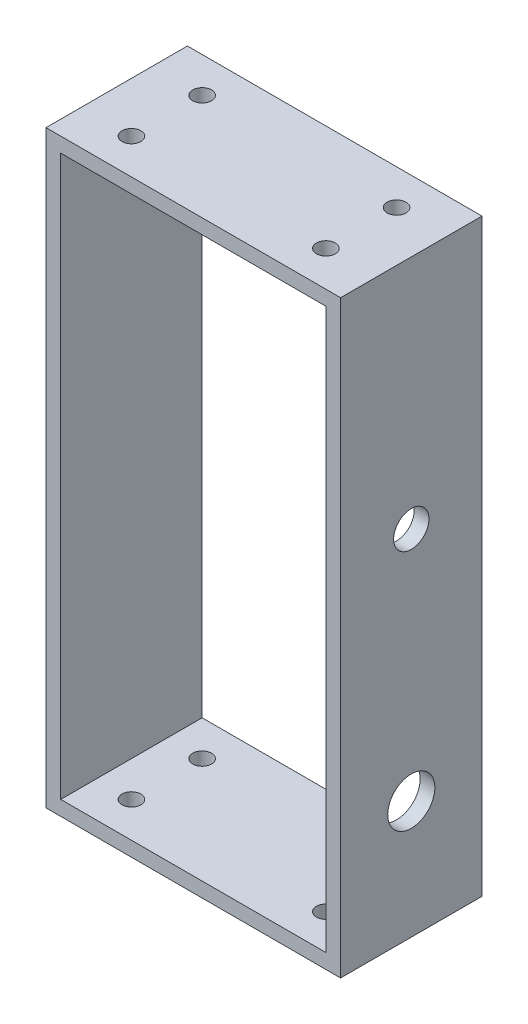
ISO-10303-21;
HEADER;
FILE_DESCRIPTION(('STEP AP214'),'2;1');
FILE_NAME('part.step','',(''),(''),'','','');
FILE_SCHEMA(('AUTOMOTIVE_DESIGN { 1 0 10303 214 1 1 1 1 }'));
ENDSEC;
DATA;
#1=APPLICATION_CONTEXT('core data for automotive mechanical design processes');
#2=APPLICATION_PROTOCOL_DEFINITION('international standard','automotive_design',2000,#1);
#3=PRODUCT_CONTEXT('',#1,'mechanical');
#4=PRODUCT('Part','Part','',(#3));
#5=PRODUCT_RELATED_PRODUCT_CATEGORY('part','',(#4));
#6=PRODUCT_DEFINITION_FORMATION('','',#4);
#7=PRODUCT_DEFINITION_CONTEXT('part definition',#1,'design');
#8=PRODUCT_DEFINITION('design','',#6,#7);
#9=PRODUCT_DEFINITION_SHAPE('','',#8);
#10=(LENGTH_UNIT() NAMED_UNIT(*) SI_UNIT(.MILLI.,.METRE.));
#11=(NAMED_UNIT(*) PLANE_ANGLE_UNIT() SI_UNIT($,.RADIAN.));
#12=(NAMED_UNIT(*) SI_UNIT($,.STERADIAN.) SOLID_ANGLE_UNIT());
#13=UNCERTAINTY_MEASURE_WITH_UNIT(LENGTH_MEASURE(1.E-05),#10,'distance_accuracy_value','');
#14=(GEOMETRIC_REPRESENTATION_CONTEXT(3) GLOBAL_UNCERTAINTY_ASSIGNED_CONTEXT((#13)) GLOBAL_UNIT_ASSIGNED_CONTEXT((#10,
#11,#12)) REPRESENTATION_CONTEXT('',''));
#15=CARTESIAN_POINT('',(0.,0.,0.));
#16=DIRECTION('',(0.,0.,1.));
#17=DIRECTION('',(1.,0.,0.));
#18=AXIS2_PLACEMENT_3D('',#15,#16,#17);
#19=CARTESIAN_POINT('',(0.,0.,24.));
#20=DIRECTION('',(0.,0.,1.));
#21=DIRECTION('',(1.,0.,0.));
#22=AXIS2_PLACEMENT_3D('',#19,#20,#21);
#23=PLANE('',#22);
#24=DIRECTION('',(0.,1.,0.));
#25=VECTOR('',#24,1.);
#26=CARTESIAN_POINT('',(25.,50.,24.));
#27=LINE('',#26,#25);
#28=CARTESIAN_POINT('',(25.,-50.,24.));
#29=VERTEX_POINT('',#28);
#30=CARTESIAN_POINT('',(25.,50.,24.));
#31=VERTEX_POINT('',#30);
#32=EDGE_CURVE('E143',#29,#31,#27,.T.);
#33=ORIENTED_EDGE('',*,*,#32,.T.);
#34=DIRECTION('',(-1.,0.,0.));
#35=VECTOR('',#34,1.);
#36=CARTESIAN_POINT('',(-25.,50.,24.));
#37=LINE('',#36,#35);
#38=CARTESIAN_POINT('',(-25.,50.,24.));
#39=VERTEX_POINT('',#38);
#40=EDGE_CURVE('E146',#31,#39,#37,.T.);
#41=ORIENTED_EDGE('',*,*,#40,.T.);
#42=DIRECTION('',(0.,-1.,0.));
#43=VECTOR('',#42,1.);
#44=CARTESIAN_POINT('',(-25.,50.,24.));
#45=LINE('',#44,#43);
#46=CARTESIAN_POINT('',(-25.,-50.,24.));
#47=VERTEX_POINT('',#46);
#48=EDGE_CURVE('E149',#39,#47,#45,.T.);
#49=ORIENTED_EDGE('',*,*,#48,.T.);
#50=DIRECTION('',(1.,0.,0.));
#51=VECTOR('',#50,1.);
#52=CARTESIAN_POINT('',(-25.,-50.,24.));
#53=LINE('',#52,#51);
#54=EDGE_CURVE('E151',#47,#29,#53,.T.);
#55=ORIENTED_EDGE('',*,*,#54,.T.);
#56=EDGE_LOOP('',(#33,#41,#49,#55));
#57=FACE_BOUND('',#56,.T.);
#58=DIRECTION('',(1.,0.,0.));
#59=VECTOR('',#58,1.);
#60=CARTESIAN_POINT('',(-22.5,-47.5,24.));
#61=LINE('',#60,#59);
#62=CARTESIAN_POINT('',(-22.5,-47.5,24.));
#63=VERTEX_POINT('',#62);
#64=CARTESIAN_POINT('',(22.5,-47.5,24.));
#65=VERTEX_POINT('',#64);
#66=EDGE_CURVE('E113',#63,#65,#61,.T.);
#67=ORIENTED_EDGE('',*,*,#66,.F.);
#68=DIRECTION('',(0.,-1.,0.));
#69=VECTOR('',#68,1.);
#70=CARTESIAN_POINT('',(-22.5,47.5,24.));
#71=LINE('',#70,#69);
#72=CARTESIAN_POINT('',(-22.5,47.5,24.));
#73=VERTEX_POINT('',#72);
#74=EDGE_CURVE('E105',#73,#63,#71,.T.);
#75=ORIENTED_EDGE('',*,*,#74,.F.);
#76=DIRECTION('',(-1.,0.,0.));
#77=VECTOR('',#76,1.);
#78=CARTESIAN_POINT('',(-22.5,47.5,24.));
#79=LINE('',#78,#77);
#80=CARTESIAN_POINT('',(22.5,47.5,24.));
#81=VERTEX_POINT('',#80);
#82=EDGE_CURVE('E127',#81,#73,#79,.T.);
#83=ORIENTED_EDGE('',*,*,#82,.F.);
#84=DIRECTION('',(0.,1.,0.));
#85=VECTOR('',#84,1.);
#86=CARTESIAN_POINT('',(22.5,47.5,24.));
#87=LINE('',#86,#85);
#88=EDGE_CURVE('E125',#65,#81,#87,.T.);
#89=ORIENTED_EDGE('',*,*,#88,.F.);
#90=EDGE_LOOP('',(#67,#75,#83,#89));
#91=FACE_BOUND('',#90,.T.);
#92=ADVANCED_FACE('F38',(#57,#91),#23,.T.);
#93=CARTESIAN_POINT('',(0.,0.,0.));
#94=DIRECTION('',(0.,0.,1.));
#95=DIRECTION('',(1.,0.,0.));
#96=AXIS2_PLACEMENT_3D('',#93,#94,#95);
#97=PLANE('',#96);
#98=DIRECTION('',(0.,1.,0.));
#99=VECTOR('',#98,1.);
#100=CARTESIAN_POINT('',(25.,50.,0.));
#101=LINE('',#100,#99);
#102=CARTESIAN_POINT('',(25.,-50.,0.));
#103=VERTEX_POINT('',#102);
#104=CARTESIAN_POINT('',(25.,50.,0.));
#105=VERTEX_POINT('',#104);
#106=EDGE_CURVE('E121',#103,#105,#101,.T.);
#107=ORIENTED_EDGE('',*,*,#106,.F.);
#108=DIRECTION('',(1.,0.,0.));
#109=VECTOR('',#108,1.);
#110=CARTESIAN_POINT('',(-25.,-50.,0.));
#111=LINE('',#110,#109);
#112=CARTESIAN_POINT('',(-25.,-50.,0.));
#113=VERTEX_POINT('',#112);
#114=EDGE_CURVE('E147',#113,#103,#111,.T.);
#115=ORIENTED_EDGE('',*,*,#114,.F.);
#116=DIRECTION('',(0.,-1.,0.));
#117=VECTOR('',#116,1.);
#118=CARTESIAN_POINT('',(-25.,50.,0.));
#119=LINE('',#118,#117);
#120=CARTESIAN_POINT('',(-25.,50.,0.));
#121=VERTEX_POINT('',#120);
#122=EDGE_CURVE('E158',#121,#113,#119,.T.);
#123=ORIENTED_EDGE('',*,*,#122,.F.);
#124=DIRECTION('',(-1.,0.,0.));
#125=VECTOR('',#124,1.);
#126=CARTESIAN_POINT('',(-25.,50.,0.));
#127=LINE('',#126,#125);
#128=EDGE_CURVE('E156',#105,#121,#127,.T.);
#129=ORIENTED_EDGE('',*,*,#128,.F.);
#130=EDGE_LOOP('',(#107,#115,#123,#129));
#131=FACE_BOUND('',#130,.T.);
#132=DIRECTION('',(0.,-1.,0.));
#133=VECTOR('',#132,1.);
#134=CARTESIAN_POINT('',(-22.5,47.5,0.));
#135=LINE('',#134,#133);
#136=CARTESIAN_POINT('',(-22.5,47.5,0.));
#137=VERTEX_POINT('',#136);
#138=CARTESIAN_POINT('',(-22.5,-47.5,0.));
#139=VERTEX_POINT('',#138);
#140=EDGE_CURVE('E63',#137,#139,#135,.T.);
#141=ORIENTED_EDGE('',*,*,#140,.T.);
#142=DIRECTION('',(1.,0.,0.));
#143=VECTOR('',#142,1.);
#144=CARTESIAN_POINT('',(-22.5,-47.5,0.));
#145=LINE('',#144,#143);
#146=CARTESIAN_POINT('',(22.5,-47.5,0.));
#147=VERTEX_POINT('',#146);
#148=EDGE_CURVE('E120',#139,#147,#145,.T.);
#149=ORIENTED_EDGE('',*,*,#148,.T.);
#150=DIRECTION('',(0.,1.,0.));
#151=VECTOR('',#150,1.);
#152=CARTESIAN_POINT('',(22.5,47.5,0.));
#153=LINE('',#152,#151);
#154=CARTESIAN_POINT('',(22.5,47.5,0.));
#155=VERTEX_POINT('',#154);
#156=EDGE_CURVE('E135',#147,#155,#153,.T.);
#157=ORIENTED_EDGE('',*,*,#156,.T.);
#158=DIRECTION('',(-1.,0.,0.));
#159=VECTOR('',#158,1.);
#160=CARTESIAN_POINT('',(-22.5,47.5,0.));
#161=LINE('',#160,#159);
#162=EDGE_CURVE('E114',#155,#137,#161,.T.);
#163=ORIENTED_EDGE('',*,*,#162,.T.);
#164=EDGE_LOOP('',(#141,#149,#157,#163));
#165=FACE_BOUND('',#164,.T.);
#166=ADVANCED_FACE('F228',(#131,#165),#97,.F.);
#167=CARTESIAN_POINT('',(25.,50.,24.));
#168=DIRECTION('',(-1.,0.,0.));
#169=DIRECTION('',(0.,-1.,0.));
#170=AXIS2_PLACEMENT_3D('',#167,#168,#169);
#171=PLANE('',#170);
#172=CARTESIAN_POINT('',(25.,9.99999999999997,12.));
#173=DIRECTION('',(-1.,0.,0.));
#174=DIRECTION('',(0.,-1.,0.));
#175=AXIS2_PLACEMENT_3D('',#172,#173,#174);
#176=CIRCLE('',#175,3.);
#177=CARTESIAN_POINT('',(25.,6.99999999999997,12.));
#178=VERTEX_POINT('',#177);
#179=EDGE_CURVE('E256',#178,#178,#176,.F.);
#180=ORIENTED_EDGE('',*,*,#179,.F.);
#181=EDGE_LOOP('',(#180));
#182=FACE_BOUND('',#181,.T.);
#183=CARTESIAN_POINT('',(25.,-30.,12.));
#184=DIRECTION('',(-1.,0.,0.));
#185=DIRECTION('',(0.,-1.,0.));
#186=AXIS2_PLACEMENT_3D('',#183,#184,#185);
#187=CIRCLE('',#186,4.);
#188=CARTESIAN_POINT('',(25.,-34.,12.));
#189=VERTEX_POINT('',#188);
#190=EDGE_CURVE('E260',#189,#189,#187,.F.);
#191=ORIENTED_EDGE('',*,*,#190,.F.);
#192=EDGE_LOOP('',(#191));
#193=FACE_BOUND('',#192,.T.);
#194=ORIENTED_EDGE('',*,*,#106,.T.);
#195=DIRECTION('',(0.,0.,-1.));
#196=VECTOR('',#195,1.);
#197=CARTESIAN_POINT('',(25.,50.,24.));
#198=LINE('',#197,#196);
#199=EDGE_CURVE('E11',#31,#105,#198,.T.);
#200=ORIENTED_EDGE('',*,*,#199,.F.);
#201=ORIENTED_EDGE('',*,*,#32,.F.);
#202=DIRECTION('',(0.,0.,-1.));
#203=VECTOR('',#202,1.);
#204=CARTESIAN_POINT('',(25.,-50.,24.));
#205=LINE('',#204,#203);
#206=EDGE_CURVE('E153',#29,#103,#205,.T.);
#207=ORIENTED_EDGE('',*,*,#206,.T.);
#208=EDGE_LOOP('',(#194,#200,#201,#207));
#209=FACE_BOUND('',#208,.T.);
#210=ADVANCED_FACE('F40',(#182,#193,#209),#171,.F.);
#211=CARTESIAN_POINT('',(-25.,50.,24.));
#212=DIRECTION('',(0.,-1.,0.));
#213=DIRECTION('',(0.,0.,-1.));
#214=AXIS2_PLACEMENT_3D('',#211,#212,#213);
#215=PLANE('',#214);
#216=CARTESIAN_POINT('',(16.5,50.,6.));
#217=DIRECTION('',(0.,-1.,0.));
#218=DIRECTION('',(0.,0.,-1.));
#219=AXIS2_PLACEMENT_3D('',#216,#217,#218);
#220=CIRCLE('',#219,1.6);
#221=CARTESIAN_POINT('',(16.5,50.,4.4));
#222=VERTEX_POINT('',#221);
#223=EDGE_CURVE('E133',#222,#222,#220,.T.);
#224=ORIENTED_EDGE('',*,*,#223,.T.);
#225=EDGE_LOOP('',(#224));
#226=FACE_BOUND('',#225,.T.);
#227=CARTESIAN_POINT('',(-16.5,50.,18.));
#228=DIRECTION('',(0.,-1.,0.));
#229=DIRECTION('',(0.,0.,-1.));
#230=AXIS2_PLACEMENT_3D('',#227,#228,#229);
#231=CIRCLE('',#230,1.6);
#232=CARTESIAN_POINT('',(-16.5,50.,16.4));
#233=VERTEX_POINT('',#232);
#234=EDGE_CURVE('E184',#233,#233,#231,.T.);
#235=ORIENTED_EDGE('',*,*,#234,.T.);
#236=EDGE_LOOP('',(#235));
#237=FACE_BOUND('',#236,.T.);
#238=CARTESIAN_POINT('',(16.5,50.,18.));
#239=DIRECTION('',(0.,-1.,0.));
#240=DIRECTION('',(0.,0.,-1.));
#241=AXIS2_PLACEMENT_3D('',#238,#239,#240);
#242=CIRCLE('',#241,1.6);
#243=CARTESIAN_POINT('',(16.5,50.,16.4));
#244=VERTEX_POINT('',#243);
#245=EDGE_CURVE('E180',#244,#244,#242,.T.);
#246=ORIENTED_EDGE('',*,*,#245,.T.);
#247=EDGE_LOOP('',(#246));
#248=FACE_BOUND('',#247,.T.);
#249=CARTESIAN_POINT('',(-16.5,50.,6.));
#250=DIRECTION('',(0.,-1.,0.));
#251=DIRECTION('',(0.,0.,-1.));
#252=AXIS2_PLACEMENT_3D('',#249,#250,#251);
#253=CIRCLE('',#252,1.6);
#254=CARTESIAN_POINT('',(-16.5,50.,4.4));
#255=VERTEX_POINT('',#254);
#256=EDGE_CURVE('E176',#255,#255,#253,.T.);
#257=ORIENTED_EDGE('',*,*,#256,.T.);
#258=EDGE_LOOP('',(#257));
#259=FACE_BOUND('',#258,.T.);
#260=ORIENTED_EDGE('',*,*,#128,.T.);
#261=DIRECTION('',(0.,0.,-1.));
#262=VECTOR('',#261,1.);
#263=CARTESIAN_POINT('',(-25.,50.,24.));
#264=LINE('',#263,#262);
#265=EDGE_CURVE('E47',#39,#121,#264,.T.);
#266=ORIENTED_EDGE('',*,*,#265,.F.);
#267=ORIENTED_EDGE('',*,*,#40,.F.);
#268=ORIENTED_EDGE('',*,*,#199,.T.);
#269=EDGE_LOOP('',(#260,#266,#267,#268));
#270=FACE_BOUND('',#269,.T.);
#271=ADVANCED_FACE('F201',(#226,#237,#248,#259,#270),#215,.F.);
#272=CARTESIAN_POINT('',(-25.,50.,24.));
#273=DIRECTION('',(1.,0.,0.));
#274=DIRECTION('',(0.,1.,0.));
#275=AXIS2_PLACEMENT_3D('',#272,#273,#274);
#276=PLANE('',#275);
#277=ORIENTED_EDGE('',*,*,#122,.T.);
#278=DIRECTION('',(0.,0.,-1.));
#279=VECTOR('',#278,1.);
#280=CARTESIAN_POINT('',(-25.,-50.,24.));
#281=LINE('',#280,#279);
#282=EDGE_CURVE('E163',#47,#113,#281,.T.);
#283=ORIENTED_EDGE('',*,*,#282,.F.);
#284=ORIENTED_EDGE('',*,*,#48,.F.);
#285=ORIENTED_EDGE('',*,*,#265,.T.);
#286=EDGE_LOOP('',(#277,#283,#284,#285));
#287=FACE_BOUND('',#286,.T.);
#288=ADVANCED_FACE('F242',(#287),#276,.F.);
#289=CARTESIAN_POINT('',(-25.,-50.,24.));
#290=DIRECTION('',(0.,1.,0.));
#291=DIRECTION('',(0.,0.,1.));
#292=AXIS2_PLACEMENT_3D('',#289,#290,#291);
#293=PLANE('',#292);
#294=CARTESIAN_POINT('',(16.5,-50.,6.));
#295=DIRECTION('',(0.,1.,0.));
#296=DIRECTION('',(0.,0.,1.));
#297=AXIS2_PLACEMENT_3D('',#294,#295,#296);
#298=CIRCLE('',#297,1.6);
#299=CARTESIAN_POINT('',(16.5,-50.,7.6));
#300=VERTEX_POINT('',#299);
#301=EDGE_CURVE('E307',#300,#300,#298,.T.);
#302=ORIENTED_EDGE('',*,*,#301,.T.);
#303=EDGE_LOOP('',(#302));
#304=FACE_BOUND('',#303,.T.);
#305=CARTESIAN_POINT('',(-16.5,-50.,18.));
#306=DIRECTION('',(0.,1.,0.));
#307=DIRECTION('',(0.,0.,1.));
#308=AXIS2_PLACEMENT_3D('',#305,#306,#307);
#309=CIRCLE('',#308,1.6);
#310=CARTESIAN_POINT('',(-16.5,-50.,19.6));
#311=VERTEX_POINT('',#310);
#312=EDGE_CURVE('E308',#311,#311,#309,.T.);
#313=ORIENTED_EDGE('',*,*,#312,.T.);
#314=EDGE_LOOP('',(#313));
#315=FACE_BOUND('',#314,.T.);
#316=CARTESIAN_POINT('',(16.5,-50.,18.));
#317=DIRECTION('',(0.,1.,0.));
#318=DIRECTION('',(0.,0.,1.));
#319=AXIS2_PLACEMENT_3D('',#316,#317,#318);
#320=CIRCLE('',#319,1.6);
#321=CARTESIAN_POINT('',(16.5,-50.,19.6));
#322=VERTEX_POINT('',#321);
#323=EDGE_CURVE('E311',#322,#322,#320,.T.);
#324=ORIENTED_EDGE('',*,*,#323,.T.);
#325=EDGE_LOOP('',(#324));
#326=FACE_BOUND('',#325,.T.);
#327=CARTESIAN_POINT('',(-16.5,-50.,6.));
#328=DIRECTION('',(0.,1.,0.));
#329=DIRECTION('',(0.,0.,1.));
#330=AXIS2_PLACEMENT_3D('',#327,#328,#329);
#331=CIRCLE('',#330,1.6);
#332=CARTESIAN_POINT('',(-16.5,-50.,7.6));
#333=VERTEX_POINT('',#332);
#334=EDGE_CURVE('E172',#333,#333,#331,.T.);
#335=ORIENTED_EDGE('',*,*,#334,.T.);
#336=EDGE_LOOP('',(#335));
#337=FACE_BOUND('',#336,.T.);
#338=ORIENTED_EDGE('',*,*,#114,.T.);
#339=ORIENTED_EDGE('',*,*,#206,.F.);
#340=ORIENTED_EDGE('',*,*,#54,.F.);
#341=ORIENTED_EDGE('',*,*,#282,.T.);
#342=EDGE_LOOP('',(#338,#339,#340,#341));
#343=FACE_BOUND('',#342,.T.);
#344=ADVANCED_FACE('F239',(#304,#315,#326,#337,#343),#293,.F.);
#345=CARTESIAN_POINT('',(-22.5,47.5,24.));
#346=DIRECTION('',(1.,0.,0.));
#347=DIRECTION('',(0.,1.,0.));
#348=AXIS2_PLACEMENT_3D('',#345,#346,#347);
#349=PLANE('',#348);
#350=ORIENTED_EDGE('',*,*,#140,.F.);
#351=DIRECTION('',(0.,0.,-1.));
#352=VECTOR('',#351,1.);
#353=CARTESIAN_POINT('',(-22.5,47.5,24.));
#354=LINE('',#353,#352);
#355=EDGE_CURVE('E109',#73,#137,#354,.T.);
#356=ORIENTED_EDGE('',*,*,#355,.F.);
#357=ORIENTED_EDGE('',*,*,#74,.T.);
#358=DIRECTION('',(0.,0.,-1.));
#359=VECTOR('',#358,1.);
#360=CARTESIAN_POINT('',(-22.5,-47.5,24.));
#361=LINE('',#360,#359);
#362=EDGE_CURVE('E108',#63,#139,#361,.T.);
#363=ORIENTED_EDGE('',*,*,#362,.T.);
#364=EDGE_LOOP('',(#350,#356,#357,#363));
#365=FACE_BOUND('',#364,.T.);
#366=ADVANCED_FACE('F107',(#365),#349,.T.);
#367=CARTESIAN_POINT('',(-22.5,-47.5,24.));
#368=DIRECTION('',(0.,1.,0.));
#369=DIRECTION('',(0.,0.,1.));
#370=AXIS2_PLACEMENT_3D('',#367,#368,#369);
#371=PLANE('',#370);
#372=CARTESIAN_POINT('',(16.5,-47.5,6.));
#373=DIRECTION('',(0.,1.,0.));
#374=DIRECTION('',(0.,0.,1.));
#375=AXIS2_PLACEMENT_3D('',#372,#373,#374);
#376=CIRCLE('',#375,1.6);
#377=CARTESIAN_POINT('',(16.5,-47.5,7.6));
#378=VERTEX_POINT('',#377);
#379=EDGE_CURVE('E196',#378,#378,#376,.T.);
#380=ORIENTED_EDGE('',*,*,#379,.F.);
#381=EDGE_LOOP('',(#380));
#382=FACE_BOUND('',#381,.T.);
#383=CARTESIAN_POINT('',(-16.5,-47.5,18.));
#384=DIRECTION('',(0.,1.,0.));
#385=DIRECTION('',(0.,0.,1.));
#386=AXIS2_PLACEMENT_3D('',#383,#384,#385);
#387=CIRCLE('',#386,1.6);
#388=CARTESIAN_POINT('',(-16.5,-47.5,19.6));
#389=VERTEX_POINT('',#388);
#390=EDGE_CURVE('E179',#389,#389,#387,.T.);
#391=ORIENTED_EDGE('',*,*,#390,.F.);
#392=EDGE_LOOP('',(#391));
#393=FACE_BOUND('',#392,.T.);
#394=CARTESIAN_POINT('',(16.5,-47.5,18.));
#395=DIRECTION('',(0.,1.,0.));
#396=DIRECTION('',(0.,0.,1.));
#397=AXIS2_PLACEMENT_3D('',#394,#395,#396);
#398=CIRCLE('',#397,1.6);
#399=CARTESIAN_POINT('',(16.5,-47.5,19.6));
#400=VERTEX_POINT('',#399);
#401=EDGE_CURVE('E175',#400,#400,#398,.T.);
#402=ORIENTED_EDGE('',*,*,#401,.F.);
#403=EDGE_LOOP('',(#402));
#404=FACE_BOUND('',#403,.T.);
#405=CARTESIAN_POINT('',(-16.5,-47.5,6.));
#406=DIRECTION('',(0.,1.,0.));
#407=DIRECTION('',(0.,0.,1.));
#408=AXIS2_PLACEMENT_3D('',#405,#406,#407);
#409=CIRCLE('',#408,1.6);
#410=CARTESIAN_POINT('',(-16.5,-47.5,7.6));
#411=VERTEX_POINT('',#410);
#412=EDGE_CURVE('E171',#411,#411,#409,.T.);
#413=ORIENTED_EDGE('',*,*,#412,.F.);
#414=EDGE_LOOP('',(#413));
#415=FACE_BOUND('',#414,.T.);
#416=ORIENTED_EDGE('',*,*,#148,.F.);
#417=ORIENTED_EDGE('',*,*,#362,.F.);
#418=ORIENTED_EDGE('',*,*,#66,.T.);
#419=DIRECTION('',(0.,0.,-1.));
#420=VECTOR('',#419,1.);
#421=CARTESIAN_POINT('',(22.5,-47.5,24.));
#422=LINE('',#421,#420);
#423=EDGE_CURVE('E122',#65,#147,#422,.T.);
#424=ORIENTED_EDGE('',*,*,#423,.T.);
#425=EDGE_LOOP('',(#416,#417,#418,#424));
#426=FACE_BOUND('',#425,.T.);
#427=ADVANCED_FACE('F117',(#382,#393,#404,#415,#426),#371,.T.);
#428=CARTESIAN_POINT('',(22.5,47.5,24.));
#429=DIRECTION('',(-1.,0.,0.));
#430=DIRECTION('',(0.,-1.,0.));
#431=AXIS2_PLACEMENT_3D('',#428,#429,#430);
#432=PLANE('',#431);
#433=CARTESIAN_POINT('',(22.5,9.99999999999997,12.));
#434=DIRECTION('',(-1.,0.,0.));
#435=DIRECTION('',(0.,-1.,0.));
#436=AXIS2_PLACEMENT_3D('',#433,#434,#435);
#437=CIRCLE('',#436,3.);
#438=CARTESIAN_POINT('',(22.5,6.99999999999997,12.));
#439=VERTEX_POINT('',#438);
#440=EDGE_CURVE('E318',#439,#439,#437,.F.);
#441=ORIENTED_EDGE('',*,*,#440,.T.);
#442=EDGE_LOOP('',(#441));
#443=FACE_BOUND('',#442,.T.);
#444=CARTESIAN_POINT('',(22.5,-30.,12.));
#445=DIRECTION('',(-1.,0.,0.));
#446=DIRECTION('',(0.,-1.,0.));
#447=AXIS2_PLACEMENT_3D('',#444,#445,#446);
#448=CIRCLE('',#447,4.);
#449=CARTESIAN_POINT('',(22.5,-34.,12.));
#450=VERTEX_POINT('',#449);
#451=EDGE_CURVE('E319',#450,#450,#448,.F.);
#452=ORIENTED_EDGE('',*,*,#451,.T.);
#453=EDGE_LOOP('',(#452));
#454=FACE_BOUND('',#453,.T.);
#455=ORIENTED_EDGE('',*,*,#156,.F.);
#456=ORIENTED_EDGE('',*,*,#423,.F.);
#457=ORIENTED_EDGE('',*,*,#88,.T.);
#458=DIRECTION('',(0.,0.,-1.));
#459=VECTOR('',#458,1.);
#460=CARTESIAN_POINT('',(22.5,47.5,24.));
#461=LINE('',#460,#459);
#462=EDGE_CURVE('E55',#81,#155,#461,.T.);
#463=ORIENTED_EDGE('',*,*,#462,.T.);
#464=EDGE_LOOP('',(#455,#456,#457,#463));
#465=FACE_BOUND('',#464,.T.);
#466=ADVANCED_FACE('F277',(#443,#454,#465),#432,.T.);
#467=CARTESIAN_POINT('',(-22.5,47.5,24.));
#468=DIRECTION('',(0.,-1.,0.));
#469=DIRECTION('',(0.,0.,-1.));
#470=AXIS2_PLACEMENT_3D('',#467,#468,#469);
#471=PLANE('',#470);
#472=CARTESIAN_POINT('',(16.5,47.5,6.));
#473=DIRECTION('',(0.,-1.,0.));
#474=DIRECTION('',(0.,0.,-1.));
#475=AXIS2_PLACEMENT_3D('',#472,#473,#474);
#476=CIRCLE('',#475,1.6);
#477=CARTESIAN_POINT('',(16.5,47.5,4.4));
#478=VERTEX_POINT('',#477);
#479=EDGE_CURVE('E42',#478,#478,#476,.T.);
#480=ORIENTED_EDGE('',*,*,#479,.F.);
#481=EDGE_LOOP('',(#480));
#482=FACE_BOUND('',#481,.T.);
#483=CARTESIAN_POINT('',(-16.5,47.5,18.));
#484=DIRECTION('',(0.,-1.,0.));
#485=DIRECTION('',(0.,0.,-1.));
#486=AXIS2_PLACEMENT_3D('',#483,#484,#485);
#487=CIRCLE('',#486,1.6);
#488=CARTESIAN_POINT('',(-16.5,47.5,16.4));
#489=VERTEX_POINT('',#488);
#490=EDGE_CURVE('E177',#489,#489,#487,.T.);
#491=ORIENTED_EDGE('',*,*,#490,.F.);
#492=EDGE_LOOP('',(#491));
#493=FACE_BOUND('',#492,.T.);
#494=CARTESIAN_POINT('',(16.5,47.5,18.));
#495=DIRECTION('',(0.,-1.,0.));
#496=DIRECTION('',(0.,0.,-1.));
#497=AXIS2_PLACEMENT_3D('',#494,#495,#496);
#498=CIRCLE('',#497,1.6);
#499=CARTESIAN_POINT('',(16.5,47.5,16.4));
#500=VERTEX_POINT('',#499);
#501=EDGE_CURVE('E173',#500,#500,#498,.T.);
#502=ORIENTED_EDGE('',*,*,#501,.F.);
#503=EDGE_LOOP('',(#502));
#504=FACE_BOUND('',#503,.T.);
#505=CARTESIAN_POINT('',(-16.5,47.5,6.));
#506=DIRECTION('',(0.,-1.,0.));
#507=DIRECTION('',(0.,0.,-1.));
#508=AXIS2_PLACEMENT_3D('',#505,#506,#507);
#509=CIRCLE('',#508,1.6);
#510=CARTESIAN_POINT('',(-16.5,47.5,4.4));
#511=VERTEX_POINT('',#510);
#512=EDGE_CURVE('E168',#511,#511,#509,.T.);
#513=ORIENTED_EDGE('',*,*,#512,.F.);
#514=EDGE_LOOP('',(#513));
#515=FACE_BOUND('',#514,.T.);
#516=ORIENTED_EDGE('',*,*,#162,.F.);
#517=ORIENTED_EDGE('',*,*,#462,.F.);
#518=ORIENTED_EDGE('',*,*,#82,.T.);
#519=ORIENTED_EDGE('',*,*,#355,.T.);
#520=EDGE_LOOP('',(#516,#517,#518,#519));
#521=FACE_BOUND('',#520,.T.);
#522=ADVANCED_FACE('F275',(#482,#493,#504,#515,#521),#471,.T.);
#523=CARTESIAN_POINT('',(-16.5,-50.,6.));
#524=DIRECTION('',(0.,1.,0.));
#525=DIRECTION('',(0.,0.,1.));
#526=AXIS2_PLACEMENT_3D('',#523,#524,#525);
#527=CYLINDRICAL_SURFACE('',#526,1.6);
#528=ORIENTED_EDGE('',*,*,#512,.T.);
#529=EDGE_LOOP('',(#528));
#530=FACE_BOUND('',#529,.T.);
#531=ORIENTED_EDGE('',*,*,#256,.F.);
#532=EDGE_LOOP('',(#531));
#533=FACE_BOUND('',#532,.T.);
#534=ADVANCED_FACE('F218',(#530,#533),#527,.F.);
#535=CARTESIAN_POINT('',(16.5,-50.,18.));
#536=DIRECTION('',(0.,1.,0.));
#537=DIRECTION('',(0.,0.,1.));
#538=AXIS2_PLACEMENT_3D('',#535,#536,#537);
#539=CYLINDRICAL_SURFACE('',#538,1.6);
#540=ORIENTED_EDGE('',*,*,#501,.T.);
#541=EDGE_LOOP('',(#540));
#542=FACE_BOUND('',#541,.T.);
#543=ORIENTED_EDGE('',*,*,#245,.F.);
#544=EDGE_LOOP('',(#543));
#545=FACE_BOUND('',#544,.T.);
#546=ADVANCED_FACE('F219',(#542,#545),#539,.F.);
#547=CARTESIAN_POINT('',(-16.5,-50.,18.));
#548=DIRECTION('',(0.,1.,0.));
#549=DIRECTION('',(0.,0.,1.));
#550=AXIS2_PLACEMENT_3D('',#547,#548,#549);
#551=CYLINDRICAL_SURFACE('',#550,1.6);
#552=ORIENTED_EDGE('',*,*,#490,.T.);
#553=EDGE_LOOP('',(#552));
#554=FACE_BOUND('',#553,.T.);
#555=ORIENTED_EDGE('',*,*,#234,.F.);
#556=EDGE_LOOP('',(#555));
#557=FACE_BOUND('',#556,.T.);
#558=ADVANCED_FACE('F207',(#554,#557),#551,.F.);
#559=CARTESIAN_POINT('',(16.5,-50.,6.));
#560=DIRECTION('',(0.,1.,0.));
#561=DIRECTION('',(0.,0.,1.));
#562=AXIS2_PLACEMENT_3D('',#559,#560,#561);
#563=CYLINDRICAL_SURFACE('',#562,1.6);
#564=ORIENTED_EDGE('',*,*,#479,.T.);
#565=EDGE_LOOP('',(#564));
#566=FACE_BOUND('',#565,.T.);
#567=ORIENTED_EDGE('',*,*,#223,.F.);
#568=EDGE_LOOP('',(#567));
#569=FACE_BOUND('',#568,.T.);
#570=ADVANCED_FACE('F204',(#566,#569),#563,.F.);
#571=ORIENTED_EDGE('',*,*,#412,.T.);
#572=EDGE_LOOP('',(#571));
#573=FACE_BOUND('',#572,.T.);
#574=ORIENTED_EDGE('',*,*,#334,.F.);
#575=EDGE_LOOP('',(#574));
#576=FACE_BOUND('',#575,.T.);
#577=ADVANCED_FACE('F206',(#573,#576),#527,.F.);
#578=ORIENTED_EDGE('',*,*,#401,.T.);
#579=EDGE_LOOP('',(#578));
#580=FACE_BOUND('',#579,.T.);
#581=ORIENTED_EDGE('',*,*,#323,.F.);
#582=EDGE_LOOP('',(#581));
#583=FACE_BOUND('',#582,.T.);
#584=ADVANCED_FACE('F215',(#580,#583),#539,.F.);
#585=ORIENTED_EDGE('',*,*,#390,.T.);
#586=EDGE_LOOP('',(#585));
#587=FACE_BOUND('',#586,.T.);
#588=ORIENTED_EDGE('',*,*,#312,.F.);
#589=EDGE_LOOP('',(#588));
#590=FACE_BOUND('',#589,.T.);
#591=ADVANCED_FACE('F221',(#587,#590),#551,.F.);
#592=ORIENTED_EDGE('',*,*,#379,.T.);
#593=EDGE_LOOP('',(#592));
#594=FACE_BOUND('',#593,.T.);
#595=ORIENTED_EDGE('',*,*,#301,.F.);
#596=EDGE_LOOP('',(#595));
#597=FACE_BOUND('',#596,.T.);
#598=ADVANCED_FACE('F210',(#594,#597),#563,.F.);
#599=CARTESIAN_POINT('',(25.000012,-30.,12.));
#600=DIRECTION('',(-1.,0.,0.));
#601=DIRECTION('',(0.,-1.,0.));
#602=AXIS2_PLACEMENT_3D('',#599,#600,#601);
#603=CYLINDRICAL_SURFACE('',#602,4.);
#604=CARTESIAN_POINT('',(22.5,-34.,12.));
#605=CARTESIAN_POINT('',(22.5260416666667,-34.,12.));
#606=CARTESIAN_POINT('',(22.5520833333333,-34.,12.));
#607=CARTESIAN_POINT('',(22.6041666666667,-34.,12.));
#608=CARTESIAN_POINT('',(22.6302083333333,-34.,12.));
#609=CARTESIAN_POINT('',(22.6822916666667,-34.,12.));
#610=CARTESIAN_POINT('',(22.7083333333333,-34.,12.));
#611=CARTESIAN_POINT('',(22.7604166666667,-34.,12.));
#612=CARTESIAN_POINT('',(22.7864583333333,-34.,12.));
#613=CARTESIAN_POINT('',(22.8385416666667,-34.,12.));
#614=CARTESIAN_POINT('',(22.8645833333333,-34.,12.));
#615=CARTESIAN_POINT('',(22.9166666666667,-34.,12.));
#616=CARTESIAN_POINT('',(22.9427083333333,-34.,12.));
#617=CARTESIAN_POINT('',(22.9947916666667,-34.,12.));
#618=CARTESIAN_POINT('',(23.0208333333333,-34.,12.));
#619=CARTESIAN_POINT('',(23.0729166666667,-34.,12.));
#620=CARTESIAN_POINT('',(23.0989583333333,-34.,12.));
#621=CARTESIAN_POINT('',(23.1510416666667,-34.,12.));
#622=CARTESIAN_POINT('',(23.1770833333333,-34.,12.));
#623=CARTESIAN_POINT('',(23.2291666666667,-34.,12.));
#624=CARTESIAN_POINT('',(23.2552083333333,-34.,12.));
#625=CARTESIAN_POINT('',(23.3072916666667,-34.,12.));
#626=CARTESIAN_POINT('',(23.3333333333333,-34.,12.));
#627=CARTESIAN_POINT('',(23.3854166666667,-34.,12.));
#628=CARTESIAN_POINT('',(23.4114583333333,-34.,12.));
#629=CARTESIAN_POINT('',(23.4635416666667,-34.,12.));
#630=CARTESIAN_POINT('',(23.4895833333333,-34.,12.));
#631=CARTESIAN_POINT('',(23.5416666666667,-34.,12.));
#632=CARTESIAN_POINT('',(23.5677083333333,-34.,12.));
#633=CARTESIAN_POINT('',(23.6197916666667,-34.,12.));
#634=CARTESIAN_POINT('',(23.6458333333333,-34.,12.));
#635=CARTESIAN_POINT('',(23.6979166666667,-34.,12.));
#636=CARTESIAN_POINT('',(23.7239583333333,-34.,12.));
#637=CARTESIAN_POINT('',(23.7760416666667,-34.,12.));
#638=CARTESIAN_POINT('',(23.8020833333333,-34.,12.));
#639=CARTESIAN_POINT('',(23.8541666666667,-34.,12.));
#640=CARTESIAN_POINT('',(23.8802083333333,-34.,12.));
#641=CARTESIAN_POINT('',(23.9322916666667,-34.,12.));
#642=CARTESIAN_POINT('',(23.9583333333333,-34.,12.));
#643=CARTESIAN_POINT('',(24.0104166666667,-34.,12.));
#644=CARTESIAN_POINT('',(24.0364583333333,-34.,12.));
#645=CARTESIAN_POINT('',(24.0885416666667,-34.,12.));
#646=CARTESIAN_POINT('',(24.1145833333333,-34.,12.));
#647=CARTESIAN_POINT('',(24.1666666666667,-34.,12.));
#648=CARTESIAN_POINT('',(24.1927083333333,-34.,12.));
#649=CARTESIAN_POINT('',(24.2447916666667,-34.,12.));
#650=CARTESIAN_POINT('',(24.2708333333333,-34.,12.));
#651=CARTESIAN_POINT('',(24.3229166666667,-34.,12.));
#652=CARTESIAN_POINT('',(24.3489583333333,-34.,12.));
#653=CARTESIAN_POINT('',(24.4010416666667,-34.,12.));
#654=CARTESIAN_POINT('',(24.4270833333333,-34.,12.));
#655=CARTESIAN_POINT('',(24.4791666666667,-34.,12.));
#656=CARTESIAN_POINT('',(24.5052083333333,-34.,12.));
#657=CARTESIAN_POINT('',(24.5572916666667,-34.,12.));
#658=CARTESIAN_POINT('',(24.5833333333333,-34.,12.));
#659=CARTESIAN_POINT('',(24.6354166666667,-34.,12.));
#660=CARTESIAN_POINT('',(24.6614583333333,-34.,12.));
#661=CARTESIAN_POINT('',(24.7135416666667,-34.,12.));
#662=CARTESIAN_POINT('',(24.7395833333333,-34.,12.));
#663=CARTESIAN_POINT('',(24.7916666666667,-34.,12.));
#664=CARTESIAN_POINT('',(24.8177083333333,-34.,12.));
#665=CARTESIAN_POINT('',(24.8697916666667,-34.,12.));
#666=CARTESIAN_POINT('',(24.8958333333333,-34.,12.));
#667=CARTESIAN_POINT('',(24.9479166666667,-34.,12.));
#668=CARTESIAN_POINT('',(24.9739583333333,-34.,12.));
#669=CARTESIAN_POINT('',(25.,-34.,12.));
#670=B_SPLINE_CURVE_WITH_KNOTS('',3,(#604,#605,#606,#607,#608,#609,#610,#611,#612,#613,#614,
#615,#616,#617,#618,#619,#620,#621,#622,#623,#624,#625,#626,#627,#628,#629,#630,#631,#632,#633,
#634,#635,#636,#637,#638,#639,#640,#641,#642,#643,#644,#645,#646,#647,#648,#649,#650,#651,#652,
#653,#654,#655,#656,#657,#658,#659,#660,#661,#662,#663,#664,#665,#666,#667,#668,#669),
.UNSPECIFIED.,.F.,.F.,(4,2,2,2,2,2,2,2,2,2,2,2,2,2,2,2,2,2,2,2,2,2,2,2,2,2,2,2,2,2,2,2,4),(0.,
0.0781250000000018,0.15625,0.234375000000002,0.3125,0.390625000000002,0.46875,0.546875000000002,
0.625000000000001,0.703125000000002,0.781250000000001,0.859375000000002,0.937500000000001,
1.015625,1.09375,1.171875,1.25,1.328125,1.40625,1.484375,1.5625,1.640625,1.71875,1.796875,1.875,
1.953125,2.03125000000001,2.109375,2.18750000000001,2.265625,2.34375000000001,2.421875,
2.50000000000001),.UNSPECIFIED.);
#671=EDGE_CURVE('BSEAM225',#450,#189,#670,.T.);
#672=ORIENTED_EDGE('',*,*,#451,.F.);
#673=ORIENTED_EDGE('',*,*,#190,.T.);
#674=ORIENTED_EDGE('',*,*,#671,.T.);
#675=ORIENTED_EDGE('',*,*,#671,.F.);
#676=EDGE_LOOP('',(#672,#674,#673,#675));
#677=FACE_BOUND('',#676,.T.);
#678=ADVANCED_FACE('F225',(#677),#603,.F.);
#679=CARTESIAN_POINT('',(25.000012,9.99999999999997,12.));
#680=DIRECTION('',(-1.,0.,0.));
#681=DIRECTION('',(0.,-1.,0.));
#682=AXIS2_PLACEMENT_3D('',#679,#680,#681);
#683=CYLINDRICAL_SURFACE('',#682,3.);
#684=CARTESIAN_POINT('',(22.5,6.99999999999997,12.));
#685=CARTESIAN_POINT('',(22.5260416666667,6.99999999999997,12.));
#686=CARTESIAN_POINT('',(22.5520833333333,6.99999999999997,12.));
#687=CARTESIAN_POINT('',(22.6041666666667,6.99999999999997,12.));
#688=CARTESIAN_POINT('',(22.6302083333333,6.99999999999997,12.));
#689=CARTESIAN_POINT('',(22.6822916666667,6.99999999999997,12.));
#690=CARTESIAN_POINT('',(22.7083333333333,6.99999999999997,12.));
#691=CARTESIAN_POINT('',(22.7604166666667,6.99999999999997,12.));
#692=CARTESIAN_POINT('',(22.7864583333333,6.99999999999997,12.));
#693=CARTESIAN_POINT('',(22.8385416666667,6.99999999999997,12.));
#694=CARTESIAN_POINT('',(22.8645833333333,6.99999999999997,12.));
#695=CARTESIAN_POINT('',(22.9166666666667,6.99999999999997,12.));
#696=CARTESIAN_POINT('',(22.9427083333333,6.99999999999997,12.));
#697=CARTESIAN_POINT('',(22.9947916666667,6.99999999999997,12.));
#698=CARTESIAN_POINT('',(23.0208333333333,6.99999999999997,12.));
#699=CARTESIAN_POINT('',(23.0729166666667,6.99999999999997,12.));
#700=CARTESIAN_POINT('',(23.0989583333333,6.99999999999997,12.));
#701=CARTESIAN_POINT('',(23.1510416666667,6.99999999999997,12.));
#702=CARTESIAN_POINT('',(23.1770833333333,6.99999999999997,12.));
#703=CARTESIAN_POINT('',(23.2291666666667,6.99999999999997,12.));
#704=CARTESIAN_POINT('',(23.2552083333333,6.99999999999997,12.));
#705=CARTESIAN_POINT('',(23.3072916666667,6.99999999999997,12.));
#706=CARTESIAN_POINT('',(23.3333333333333,6.99999999999997,12.));
#707=CARTESIAN_POINT('',(23.3854166666667,6.99999999999997,12.));
#708=CARTESIAN_POINT('',(23.4114583333333,6.99999999999997,12.));
#709=CARTESIAN_POINT('',(23.4635416666667,6.99999999999997,12.));
#710=CARTESIAN_POINT('',(23.4895833333333,6.99999999999997,12.));
#711=CARTESIAN_POINT('',(23.5416666666667,6.99999999999997,12.));
#712=CARTESIAN_POINT('',(23.5677083333333,6.99999999999997,12.));
#713=CARTESIAN_POINT('',(23.6197916666667,6.99999999999997,12.));
#714=CARTESIAN_POINT('',(23.6458333333333,6.99999999999997,12.));
#715=CARTESIAN_POINT('',(23.6979166666667,6.99999999999997,12.));
#716=CARTESIAN_POINT('',(23.7239583333333,6.99999999999997,12.));
#717=CARTESIAN_POINT('',(23.7760416666667,6.99999999999997,12.));
#718=CARTESIAN_POINT('',(23.8020833333333,6.99999999999997,12.));
#719=CARTESIAN_POINT('',(23.8541666666667,6.99999999999997,12.));
#720=CARTESIAN_POINT('',(23.8802083333333,6.99999999999997,12.));
#721=CARTESIAN_POINT('',(23.9322916666667,6.99999999999997,12.));
#722=CARTESIAN_POINT('',(23.9583333333333,6.99999999999997,12.));
#723=CARTESIAN_POINT('',(24.0104166666667,6.99999999999997,12.));
#724=CARTESIAN_POINT('',(24.0364583333333,6.99999999999997,12.));
#725=CARTESIAN_POINT('',(24.0885416666667,6.99999999999997,12.));
#726=CARTESIAN_POINT('',(24.1145833333333,6.99999999999997,12.));
#727=CARTESIAN_POINT('',(24.1666666666667,6.99999999999997,12.));
#728=CARTESIAN_POINT('',(24.1927083333333,6.99999999999997,12.));
#729=CARTESIAN_POINT('',(24.2447916666667,6.99999999999997,12.));
#730=CARTESIAN_POINT('',(24.2708333333333,6.99999999999997,12.));
#731=CARTESIAN_POINT('',(24.3229166666667,6.99999999999997,12.));
#732=CARTESIAN_POINT('',(24.3489583333333,6.99999999999997,12.));
#733=CARTESIAN_POINT('',(24.4010416666667,6.99999999999997,12.));
#734=CARTESIAN_POINT('',(24.4270833333333,6.99999999999997,12.));
#735=CARTESIAN_POINT('',(24.4791666666667,6.99999999999997,12.));
#736=CARTESIAN_POINT('',(24.5052083333333,6.99999999999997,12.));
#737=CARTESIAN_POINT('',(24.5572916666667,6.99999999999997,12.));
#738=CARTESIAN_POINT('',(24.5833333333333,6.99999999999997,12.));
#739=CARTESIAN_POINT('',(24.6354166666667,6.99999999999997,12.));
#740=CARTESIAN_POINT('',(24.6614583333333,6.99999999999997,12.));
#741=CARTESIAN_POINT('',(24.7135416666667,6.99999999999997,12.));
#742=CARTESIAN_POINT('',(24.7395833333333,6.99999999999997,12.));
#743=CARTESIAN_POINT('',(24.7916666666667,6.99999999999997,12.));
#744=CARTESIAN_POINT('',(24.8177083333333,6.99999999999997,12.));
#745=CARTESIAN_POINT('',(24.8697916666667,6.99999999999997,12.));
#746=CARTESIAN_POINT('',(24.8958333333333,6.99999999999997,12.));
#747=CARTESIAN_POINT('',(24.9479166666667,6.99999999999997,12.));
#748=CARTESIAN_POINT('',(24.9739583333333,6.99999999999997,12.));
#749=CARTESIAN_POINT('',(25.,6.99999999999997,12.));
#750=B_SPLINE_CURVE_WITH_KNOTS('',3,(#684,#685,#686,#687,#688,#689,#690,#691,#692,#693,#694,
#695,#696,#697,#698,#699,#700,#701,#702,#703,#704,#705,#706,#707,#708,#709,#710,#711,#712,#713,
#714,#715,#716,#717,#718,#719,#720,#721,#722,#723,#724,#725,#726,#727,#728,#729,#730,#731,#732,
#733,#734,#735,#736,#737,#738,#739,#740,#741,#742,#743,#744,#745,#746,#747,#748,#749),
.UNSPECIFIED.,.F.,.F.,(4,2,2,2,2,2,2,2,2,2,2,2,2,2,2,2,2,2,2,2,2,2,2,2,2,2,2,2,2,2,2,2,4),(0.,
0.0781249999999983,0.15625,0.234374999999998,0.312499999999997,0.390624999999999,
0.468749999999997,0.546874999999999,0.624999999999997,0.703124999999995,0.781249999999997,
0.859374999999996,0.937499999999997,1.015625,1.09375,1.171875,1.25,1.328125,1.40624999999999,
1.484375,1.56249999999999,1.640625,1.71874999999999,1.796875,1.87499999999999,1.95312499999999,
2.03124999999999,2.10937499999999,2.1875,2.26562499999999,2.34375,2.42187499999999,2.5),.UNSPECIFIED.);
#751=EDGE_CURVE('BSEAM326',#439,#178,#750,.T.);
#752=ORIENTED_EDGE('',*,*,#440,.F.);
#753=ORIENTED_EDGE('',*,*,#179,.T.);
#754=ORIENTED_EDGE('',*,*,#751,.T.);
#755=ORIENTED_EDGE('',*,*,#751,.F.);
#756=EDGE_LOOP('',(#752,#754,#753,#755));
#757=FACE_BOUND('',#756,.T.);
#758=ADVANCED_FACE('F326',(#757),#683,.F.);
#759=CLOSED_SHELL('',(#92,#166,#210,#271,#288,#344,#366,#427,#466,#522,#534,#546,#558,#570,#577,
#584,#591,#598,#678,#758));
#760=MANIFOLD_SOLID_BREP('B2',#759);
#761=ADVANCED_BREP_SHAPE_REPRESENTATION('',(#18,#760),#14);
#762=SHAPE_DEFINITION_REPRESENTATION(#9,#761);
ENDSEC;
END-ISO-10303-21;
